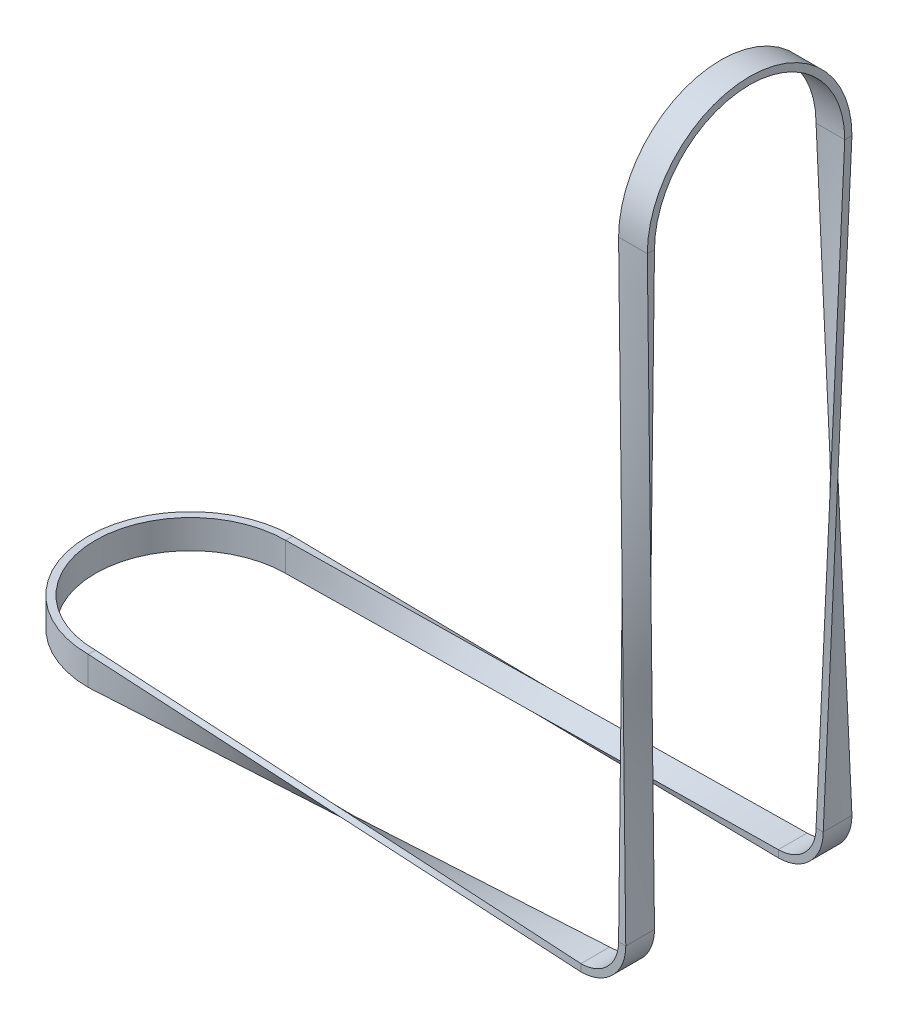
ISO-10303-21;
HEADER;
FILE_DESCRIPTION(('STEP AP214'),'2;1');
FILE_NAME('part.step','',(''),(''),'','','');
FILE_SCHEMA(('AUTOMOTIVE_DESIGN { 1 0 10303 214 1 1 1 1 }'));
ENDSEC;
DATA;
#1=APPLICATION_CONTEXT('core data for automotive mechanical design processes');
#2=APPLICATION_PROTOCOL_DEFINITION('international standard','automotive_design',2000,#1);
#3=PRODUCT_CONTEXT('',#1,'mechanical');
#4=PRODUCT('Part','Part','',(#3));
#5=PRODUCT_RELATED_PRODUCT_CATEGORY('part','',(#4));
#6=PRODUCT_DEFINITION_FORMATION('','',#4);
#7=PRODUCT_DEFINITION_CONTEXT('part definition',#1,'design');
#8=PRODUCT_DEFINITION('design','',#6,#7);
#9=PRODUCT_DEFINITION_SHAPE('','',#8);
#10=(LENGTH_UNIT() NAMED_UNIT(*) SI_UNIT(.MILLI.,.METRE.));
#11=(NAMED_UNIT(*) PLANE_ANGLE_UNIT() SI_UNIT($,.RADIAN.));
#12=(NAMED_UNIT(*) SI_UNIT($,.STERADIAN.) SOLID_ANGLE_UNIT());
#13=UNCERTAINTY_MEASURE_WITH_UNIT(LENGTH_MEASURE(1.E-05),#10,'distance_accuracy_value','');
#14=(GEOMETRIC_REPRESENTATION_CONTEXT(3) GLOBAL_UNCERTAINTY_ASSIGNED_CONTEXT((#13)) GLOBAL_UNIT_ASSIGNED_CONTEXT((#10,
#11,#12)) REPRESENTATION_CONTEXT('',''));
#15=CARTESIAN_POINT('',(0.,0.,0.));
#16=DIRECTION('',(0.,0.,1.));
#17=DIRECTION('',(1.,0.,0.));
#18=AXIS2_PLACEMENT_3D('',#15,#16,#17);
#19=CARTESIAN_POINT('',(-140.25,-7.50000000000001,28.5));
#20=CARTESIAN_POINT('',(0.,-12.5,31.5));
#21=CARTESIAN_POINT('',(-140.25,-8.83333333333335,28.5));
#22=CARTESIAN_POINT('',(0.,-12.5,30.1666666666667));
#23=CARTESIAN_POINT('',(-140.25,-10.1666666666667,28.5));
#24=CARTESIAN_POINT('',(0.,-12.5,28.8333333333333));
#25=CARTESIAN_POINT('',(-140.25,-12.8333333333333,28.5));
#26=CARTESIAN_POINT('',(0.,-12.5,26.1666666666667));
#27=CARTESIAN_POINT('',(-140.25,-14.1666666666667,28.5));
#28=CARTESIAN_POINT('',(0.,-12.5,24.8333333333333));
#29=CARTESIAN_POINT('',(-140.25,-15.5,28.5));
#30=CARTESIAN_POINT('',(0.,-12.5,23.5));
#31=B_SPLINE_SURFACE_WITH_KNOTS('',3,1,((#19,#20),(#21,#22),(#23,#24),(#25,#26),(#27,#28),(#29,
#30)),.UNSPECIFIED.,.F.,.F.,.F.,(4,2,4),(2,2),(0.,0.5,1.),(0.,1.),.UNSPECIFIED.);
#32=DIRECTION('',(0.,-1.,0.));
#33=VECTOR('',#32,1.);
#34=CARTESIAN_POINT('',(-140.25,-7.50000000000001,28.5));
#35=LINE('',#34,#33);
#36=CARTESIAN_POINT('',(-140.25,-7.50000000000001,28.5));
#37=VERTEX_POINT('',#36);
#38=CARTESIAN_POINT('',(-140.25,-10.5000000000002,28.5));
#39=VERTEX_POINT('',#38);
#40=EDGE_CURVE('E911',#37,#39,#35,.T.);
#41=DIRECTION('',(0.,1.,0.));
#42=VECTOR('',#41,1.);
#43=CARTESIAN_POINT('',(-140.25,-15.5,28.5));
#44=LINE('',#43,#42);
#45=CARTESIAN_POINT('',(-140.25,-15.5,28.5));
#46=VERTEX_POINT('',#45);
#47=EDGE_CURVE('E472',#46,#39,#44,.T.);
#48=DIRECTION('',(0.99913686125148,0.02137191147062,-0.0356198524510331));
#49=VECTOR('',#48,1.);
#50=CARTESIAN_POINT('',(-70.125,-14.,26.));
#51=LINE('',#50,#49);
#52=CARTESIAN_POINT('',(0.,-12.5,23.5));
#53=VERTEX_POINT('',#52);
#54=EDGE_CURVE('E979',#46,#53,#51,.T.);
#55=DIRECTION('',(0.,0.,-1.));
#56=VECTOR('',#55,1.);
#57=CARTESIAN_POINT('',(0.,-12.5,31.5));
#58=LINE('',#57,#56);
#59=CARTESIAN_POINT('',(0.,-12.5,31.5));
#60=VERTEX_POINT('',#59);
#61=EDGE_CURVE('E386',#60,#53,#58,.T.);
#62=DIRECTION('',(-0.99913686125148,0.035619852451033,-0.0213719114706199));
#63=VECTOR('',#62,1.);
#64=CARTESIAN_POINT('',(-70.125,-10.,30.));
#65=LINE('',#64,#63);
#66=EDGE_CURVE('E461',#60,#37,#65,.T.);
#67=ORIENTED_EDGE('',*,*,#40,.T.);
#68=ORIENTED_EDGE('',*,*,#47,.F.);
#69=ORIENTED_EDGE('',*,*,#54,.T.);
#70=ORIENTED_EDGE('',*,*,#61,.F.);
#71=ORIENTED_EDGE('',*,*,#66,.T.);
#72=EDGE_LOOP('',(#67,#68,#69,#70,#71));
#73=FACE_BOUND('',#72,.T.);
#74=ADVANCED_FACE('F49',(#73),#31,.T.);
#75=CARTESIAN_POINT('',(-140.25,-15.5,28.5));
#76=CARTESIAN_POINT('',(0.,-12.5,23.5));
#77=CARTESIAN_POINT('',(-140.25,-15.5,28.1666666666667));
#78=CARTESIAN_POINT('',(0.,-12.1666666666667,23.5));
#79=CARTESIAN_POINT('',(-140.25,-15.5,27.8333333333333));
#80=CARTESIAN_POINT('',(0.,-11.8333333333333,23.5));
#81=CARTESIAN_POINT('',(-140.25,-15.5,27.1666666666667));
#82=CARTESIAN_POINT('',(0.,-11.1666666666667,23.5));
#83=CARTESIAN_POINT('',(-140.25,-15.5,26.8333333333333));
#84=CARTESIAN_POINT('',(0.,-10.8333333333333,23.5));
#85=CARTESIAN_POINT('',(-140.25,-15.5,26.5));
#86=CARTESIAN_POINT('',(0.,-10.5,23.5));
#87=B_SPLINE_SURFACE_WITH_KNOTS('',3,1,((#75,#76),(#77,#78),(#79,#80),(#81,#82),(#83,#84),(#85,
#86)),.UNSPECIFIED.,.F.,.F.,.F.,(4,2,4),(2,2),(0.,0.5,1.),(0.,1.),.UNSPECIFIED.);
#88=DIRECTION('',(0.,0.,-1.));
#89=VECTOR('',#88,1.);
#90=CARTESIAN_POINT('',(-140.25,-15.5,28.5));
#91=LINE('',#90,#89);
#92=CARTESIAN_POINT('',(-140.25,-15.5,26.5));
#93=VERTEX_POINT('',#92);
#94=EDGE_CURVE('E902',#46,#93,#91,.T.);
#95=DIRECTION('',(0.99913686125148,0.0356198524510333,-0.0213719114706199));
#96=VECTOR('',#95,1.);
#97=CARTESIAN_POINT('',(-70.125,-13.,25.));
#98=LINE('',#97,#96);
#99=CARTESIAN_POINT('',(0.,-10.5,23.5));
#100=VERTEX_POINT('',#99);
#101=EDGE_CURVE('E977',#93,#100,#98,.T.);
#102=DIRECTION('',(0.,-1.,0.));
#103=VECTOR('',#102,1.);
#104=CARTESIAN_POINT('',(0.,-10.5,23.5));
#105=LINE('',#104,#103);
#106=EDGE_CURVE('E61',#100,#53,#105,.T.);
#107=ORIENTED_EDGE('',*,*,#94,.T.);
#108=ORIENTED_EDGE('',*,*,#101,.T.);
#109=ORIENTED_EDGE('',*,*,#106,.T.);
#110=ORIENTED_EDGE('',*,*,#54,.F.);
#111=EDGE_LOOP('',(#107,#108,#109,#110));
#112=FACE_BOUND('',#111,.T.);
#113=ADVANCED_FACE('F445',(#112),#87,.T.);
#114=CARTESIAN_POINT('',(-140.25,-7.50000000000001,26.5));
#115=CARTESIAN_POINT('',(0.,-10.5,31.5));
#116=CARTESIAN_POINT('',(-140.25,-7.50000000000001,26.8333333333333));
#117=CARTESIAN_POINT('',(0.,-10.8333333333333,31.5));
#118=CARTESIAN_POINT('',(-140.25,-7.50000000000001,27.1666666666666));
#119=CARTESIAN_POINT('',(0.,-11.1666666666667,31.5));
#120=CARTESIAN_POINT('',(-140.25,-7.50000000000001,27.8333333333333));
#121=CARTESIAN_POINT('',(0.,-11.8333333333333,31.5));
#122=CARTESIAN_POINT('',(-140.25,-7.50000000000001,28.1666666666666));
#123=CARTESIAN_POINT('',(0.,-12.1666666666667,31.5));
#124=CARTESIAN_POINT('',(-140.25,-7.50000000000001,28.5));
#125=CARTESIAN_POINT('',(0.,-12.5,31.5));
#126=B_SPLINE_SURFACE_WITH_KNOTS('',3,1,((#114,#115),(#116,#117),(#118,#119),(#120,#121),(#122,
#123),(#124,#125)),.UNSPECIFIED.,.F.,.F.,.F.,(4,2,4),(2,2),(0.,0.5,1.),(0.,1.),.UNSPECIFIED.);
#127=DIRECTION('',(0.,0.,-1.));
#128=VECTOR('',#127,1.);
#129=CARTESIAN_POINT('',(-140.25,-7.50000000000001,28.5));
#130=LINE('',#129,#128);
#131=CARTESIAN_POINT('',(-140.25,-7.50000000000001,26.5));
#132=VERTEX_POINT('',#131);
#133=EDGE_CURVE('E378',#37,#132,#130,.T.);
#134=DIRECTION('',(0.,-1.,0.));
#135=VECTOR('',#134,1.);
#136=CARTESIAN_POINT('',(0.,-10.5,31.5));
#137=LINE('',#136,#135);
#138=CARTESIAN_POINT('',(0.,-10.5,31.5));
#139=VERTEX_POINT('',#138);
#140=EDGE_CURVE('E390',#139,#60,#137,.T.);
#141=DIRECTION('',(0.99913686125148,-0.0213719114706198,0.0356198524510331));
#142=VECTOR('',#141,1.);
#143=CARTESIAN_POINT('',(-70.125,-9.00000000000001,29.));
#144=LINE('',#143,#142);
#145=EDGE_CURVE('E394',#132,#139,#144,.T.);
#146=ORIENTED_EDGE('',*,*,#133,.F.);
#147=ORIENTED_EDGE('',*,*,#66,.F.);
#148=ORIENTED_EDGE('',*,*,#140,.F.);
#149=ORIENTED_EDGE('',*,*,#145,.F.);
#150=EDGE_LOOP('',(#146,#147,#148,#149));
#151=FACE_BOUND('',#150,.T.);
#152=ADVANCED_FACE('F974',(#151),#126,.T.);
#153=CARTESIAN_POINT('',(-140.25,-15.5,26.5));
#154=CARTESIAN_POINT('',(0.,-10.5,23.5));
#155=CARTESIAN_POINT('',(-140.25,-14.1666666666667,26.5));
#156=CARTESIAN_POINT('',(0.,-10.5,24.8333333333333));
#157=CARTESIAN_POINT('',(-140.25,-12.8333333333333,26.5));
#158=CARTESIAN_POINT('',(0.,-10.5,26.1666666666666));
#159=CARTESIAN_POINT('',(-140.25,-10.1666666666667,26.5));
#160=CARTESIAN_POINT('',(0.,-10.5,28.8333333333332));
#161=CARTESIAN_POINT('',(-140.25,-8.83333333333335,26.5));
#162=CARTESIAN_POINT('',(0.,-10.5,30.1666666666666));
#163=CARTESIAN_POINT('',(-140.25,-7.50000000000001,26.5));
#164=CARTESIAN_POINT('',(0.,-10.5,31.5));
#165=B_SPLINE_SURFACE_WITH_KNOTS('',3,1,((#153,#154),(#155,#156),(#157,#158),(#159,#160),(#161,
#162),(#163,#164)),.UNSPECIFIED.,.F.,.F.,.F.,(4,2,4),(2,2),(0.,0.5,1.),(0.,1.),.UNSPECIFIED.);
#166=DIRECTION('',(0.,-1.,0.));
#167=VECTOR('',#166,1.);
#168=CARTESIAN_POINT('',(-140.25,-7.50000000000001,26.5));
#169=LINE('',#168,#167);
#170=CARTESIAN_POINT('',(-140.25,-12.5000000000001,26.5));
#171=VERTEX_POINT('',#170);
#172=EDGE_CURVE('E912',#132,#171,#169,.T.);
#173=DIRECTION('',(0.,0.,-1.));
#174=VECTOR('',#173,1.);
#175=CARTESIAN_POINT('',(0.,-10.5,31.5));
#176=LINE('',#175,#174);
#177=EDGE_CURVE('E12',#139,#100,#176,.T.);
#178=EDGE_CURVE('E483',#171,#93,#169,.T.);
#179=ORIENTED_EDGE('',*,*,#172,.F.);
#180=ORIENTED_EDGE('',*,*,#145,.T.);
#181=ORIENTED_EDGE('',*,*,#177,.T.);
#182=ORIENTED_EDGE('',*,*,#101,.F.);
#183=ORIENTED_EDGE('',*,*,#178,.F.);
#184=EDGE_LOOP('',(#179,#180,#181,#182,#183));
#185=FACE_BOUND('',#184,.T.);
#186=ADVANCED_FACE('F51',(#185),#165,.T.);
#187=CARTESIAN_POINT('',(0.,0.,27.5));
#188=DIRECTION('',(0.,0.,-1.));
#189=DIRECTION('',(-1.,0.,0.));
#190=AXIS2_PLACEMENT_3D('',#187,#188,#189);
#191=CYLINDRICAL_SURFACE('',#190,10.5);
#192=CARTESIAN_POINT('',(0.,0.,23.5));
#193=DIRECTION('',(0.,0.,-1.));
#194=DIRECTION('',(1.,0.,0.));
#195=AXIS2_PLACEMENT_3D('',#192,#193,#194);
#196=CIRCLE('',#195,10.5);
#197=CARTESIAN_POINT('',(10.5,0.,23.5));
#198=VERTEX_POINT('',#197);
#199=EDGE_CURVE('E353',#198,#100,#196,.T.);
#200=ORIENTED_EDGE('',*,*,#199,.T.);
#201=ORIENTED_EDGE('',*,*,#177,.F.);
#202=CARTESIAN_POINT('',(0.,0.,31.5));
#203=DIRECTION('',(0.,0.,-1.));
#204=DIRECTION('',(1.,0.,0.));
#205=AXIS2_PLACEMENT_3D('',#202,#203,#204);
#206=CIRCLE('',#205,10.5);
#207=CARTESIAN_POINT('',(10.5,0.,31.5));
#208=VERTEX_POINT('',#207);
#209=EDGE_CURVE('E356',#208,#139,#206,.T.);
#210=ORIENTED_EDGE('',*,*,#209,.F.);
#211=DIRECTION('',(0.,0.,-1.));
#212=VECTOR('',#211,1.);
#213=CARTESIAN_POINT('',(10.5,0.,31.5));
#214=LINE('',#213,#212);
#215=EDGE_CURVE('E197',#208,#198,#214,.T.);
#216=ORIENTED_EDGE('',*,*,#215,.T.);
#217=EDGE_LOOP('',(#200,#201,#210,#216));
#218=FACE_BOUND('',#217,.T.);
#219=ADVANCED_FACE('F301',(#218),#191,.F.);
#220=CARTESIAN_POINT('',(10.5,0.,23.5));
#221=DIRECTION('',(0.,0.,-1.));
#222=DIRECTION('',(-1.,0.,0.));
#223=AXIS2_PLACEMENT_3D('',#220,#221,#222);
#224=PLANE('',#223);
#225=CARTESIAN_POINT('',(0.,0.,23.5));
#226=DIRECTION('',(0.,0.,-1.));
#227=DIRECTION('',(1.,0.,0.));
#228=AXIS2_PLACEMENT_3D('',#225,#226,#227);
#229=CIRCLE('',#228,12.5);
#230=CARTESIAN_POINT('',(12.5,0.,23.5));
#231=VERTEX_POINT('',#230);
#232=EDGE_CURVE('E363',#231,#53,#229,.T.);
#233=ORIENTED_EDGE('',*,*,#232,.T.);
#234=ORIENTED_EDGE('',*,*,#106,.F.);
#235=ORIENTED_EDGE('',*,*,#199,.F.);
#236=DIRECTION('',(1.,0.,0.));
#237=VECTOR('',#236,1.);
#238=CARTESIAN_POINT('',(10.5,0.,23.5));
#239=LINE('',#238,#237);
#240=EDGE_CURVE('E328',#198,#231,#239,.T.);
#241=ORIENTED_EDGE('',*,*,#240,.T.);
#242=EDGE_LOOP('',(#233,#234,#235,#241));
#243=FACE_BOUND('',#242,.T.);
#244=ADVANCED_FACE('F360',(#243),#224,.T.);
#245=CARTESIAN_POINT('',(0.,0.,27.5));
#246=DIRECTION('',(0.,0.,-1.));
#247=DIRECTION('',(-1.,0.,0.));
#248=AXIS2_PLACEMENT_3D('',#245,#246,#247);
#249=CYLINDRICAL_SURFACE('',#248,12.5);
#250=CARTESIAN_POINT('',(0.,0.,31.5));
#251=DIRECTION('',(0.,0.,-1.));
#252=DIRECTION('',(1.,0.,0.));
#253=AXIS2_PLACEMENT_3D('',#250,#251,#252);
#254=CIRCLE('',#253,12.5);
#255=CARTESIAN_POINT('',(12.5,0.,31.5));
#256=VERTEX_POINT('',#255);
#257=EDGE_CURVE('E365',#256,#60,#254,.T.);
#258=ORIENTED_EDGE('',*,*,#257,.T.);
#259=ORIENTED_EDGE('',*,*,#61,.T.);
#260=ORIENTED_EDGE('',*,*,#232,.F.);
#261=DIRECTION('',(0.,0.,1.));
#262=VECTOR('',#261,1.);
#263=CARTESIAN_POINT('',(12.5,0.,23.5));
#264=LINE('',#263,#262);
#265=EDGE_CURVE('E348',#231,#256,#264,.T.);
#266=ORIENTED_EDGE('',*,*,#265,.T.);
#267=EDGE_LOOP('',(#258,#259,#260,#266));
#268=FACE_BOUND('',#267,.T.);
#269=ADVANCED_FACE('F427',(#268),#249,.T.);
#270=CARTESIAN_POINT('',(12.5,0.,31.5));
#271=DIRECTION('',(0.,0.,1.));
#272=DIRECTION('',(1.,0.,0.));
#273=AXIS2_PLACEMENT_3D('',#270,#271,#272);
#274=PLANE('',#273);
#275=ORIENTED_EDGE('',*,*,#140,.T.);
#276=ORIENTED_EDGE('',*,*,#257,.F.);
#277=DIRECTION('',(-1.,0.,0.));
#278=VECTOR('',#277,1.);
#279=CARTESIAN_POINT('',(12.5,0.,31.5));
#280=LINE('',#279,#278);
#281=EDGE_CURVE('E240',#256,#208,#280,.T.);
#282=ORIENTED_EDGE('',*,*,#281,.T.);
#283=ORIENTED_EDGE('',*,*,#209,.T.);
#284=EDGE_LOOP('',(#275,#276,#282,#283));
#285=FACE_BOUND('',#284,.T.);
#286=ADVANCED_FACE('F300',(#285),#274,.T.);
#287=CARTESIAN_POINT('',(12.5,0.,31.5));
#288=CARTESIAN_POINT('',(7.5,167.,28.5));
#289=CARTESIAN_POINT('',(12.5,0.,30.1666666666667));
#290=CARTESIAN_POINT('',(8.83333333333331,167.,28.5));
#291=CARTESIAN_POINT('',(12.5,0.,28.8333333333333));
#292=CARTESIAN_POINT('',(10.1666666666666,167.,28.5));
#293=CARTESIAN_POINT('',(12.5,0.,26.1666666666667));
#294=CARTESIAN_POINT('',(12.8333333333333,167.,28.5));
#295=CARTESIAN_POINT('',(12.5,0.,24.8333333333333));
#296=CARTESIAN_POINT('',(14.1666666666666,167.,28.5));
#297=CARTESIAN_POINT('',(12.5,0.,23.5));
#298=CARTESIAN_POINT('',(15.5,167.,28.5));
#299=B_SPLINE_SURFACE_WITH_KNOTS('',3,1,((#287,#288),(#289,#290),(#291,#292),(#293,#294),(#295,
#296),(#297,#298)),.UNSPECIFIED.,.F.,.F.,.F.,(4,2,4),(2,2),(0.,0.5,1.),(0.,1.),.UNSPECIFIED.);
#300=DIRECTION('',(0.0179531316907863,0.99939099745377,0.0299218861513105));
#301=VECTOR('',#300,1.);
#302=CARTESIAN_POINT('',(14.,83.5,26.));
#303=LINE('',#302,#301);
#304=CARTESIAN_POINT('',(15.5,167.,28.5));
#305=VERTEX_POINT('',#304);
#306=EDGE_CURVE('E232',#231,#305,#303,.T.);
#307=DIRECTION('',(1.,0.,0.));
#308=VECTOR('',#307,1.);
#309=CARTESIAN_POINT('',(7.5,167.,28.5));
#310=LINE('',#309,#308);
#311=CARTESIAN_POINT('',(7.5,167.,28.5));
#312=VERTEX_POINT('',#311);
#313=EDGE_CURVE('E221',#312,#305,#310,.T.);
#314=DIRECTION('',(0.0299218861513105,-0.99939099745377,0.0179531316907863));
#315=VECTOR('',#314,1.);
#316=CARTESIAN_POINT('',(10.,83.5,30.));
#317=LINE('',#316,#315);
#318=EDGE_CURVE('E220',#312,#256,#317,.T.);
#319=ORIENTED_EDGE('',*,*,#265,.F.);
#320=ORIENTED_EDGE('',*,*,#306,.T.);
#321=ORIENTED_EDGE('',*,*,#313,.F.);
#322=ORIENTED_EDGE('',*,*,#318,.T.);
#323=EDGE_LOOP('',(#319,#320,#321,#322));
#324=FACE_BOUND('',#323,.T.);
#325=ADVANCED_FACE('F289',(#324),#299,.T.);
#326=CARTESIAN_POINT('',(12.5,0.,23.5));
#327=CARTESIAN_POINT('',(15.5,167.,28.5));
#328=CARTESIAN_POINT('',(12.1666666666667,0.,23.5));
#329=CARTESIAN_POINT('',(15.5,167.,28.1666666666667));
#330=CARTESIAN_POINT('',(11.8333333333333,0.,23.5));
#331=CARTESIAN_POINT('',(15.5,167.,27.8333333333333));
#332=CARTESIAN_POINT('',(11.1666666666667,0.,23.5));
#333=CARTESIAN_POINT('',(15.5,167.,27.1666666666666));
#334=CARTESIAN_POINT('',(10.8333333333333,0.,23.5));
#335=CARTESIAN_POINT('',(15.5,167.,26.8333333333333));
#336=CARTESIAN_POINT('',(10.5,0.,23.5));
#337=CARTESIAN_POINT('',(15.5,167.,26.5));
#338=B_SPLINE_SURFACE_WITH_KNOTS('',3,1,((#326,#327),(#328,#329),(#330,#331),(#332,#333),(#334,
#335),(#336,#337)),.UNSPECIFIED.,.F.,.F.,.F.,(4,2,4),(2,2),(0.,0.5,1.),(0.,1.),.UNSPECIFIED.);
#339=DIRECTION('',(0.0299218861513105,0.99939099745377,0.0179531316907863));
#340=VECTOR('',#339,1.);
#341=CARTESIAN_POINT('',(13.,83.5,25.));
#342=LINE('',#341,#340);
#343=CARTESIAN_POINT('',(15.5,167.,26.5));
#344=VERTEX_POINT('',#343);
#345=EDGE_CURVE('E229',#198,#344,#342,.T.);
#346=DIRECTION('',(0.,0.,1.));
#347=VECTOR('',#346,1.);
#348=CARTESIAN_POINT('',(15.5,167.,26.5));
#349=LINE('',#348,#347);
#350=EDGE_CURVE('E198',#344,#305,#349,.T.);
#351=ORIENTED_EDGE('',*,*,#240,.F.);
#352=ORIENTED_EDGE('',*,*,#345,.T.);
#353=ORIENTED_EDGE('',*,*,#350,.T.);
#354=ORIENTED_EDGE('',*,*,#306,.F.);
#355=EDGE_LOOP('',(#351,#352,#353,#354));
#356=FACE_BOUND('',#355,.T.);
#357=ADVANCED_FACE('F257',(#356),#338,.T.);
#358=CARTESIAN_POINT('',(10.5,0.,31.5));
#359=CARTESIAN_POINT('',(7.5,167.,26.5));
#360=CARTESIAN_POINT('',(10.8333333333333,0.,31.5));
#361=CARTESIAN_POINT('',(7.5,167.,26.8333333333333));
#362=CARTESIAN_POINT('',(11.1666666666667,0.,31.5));
#363=CARTESIAN_POINT('',(7.5,167.,27.1666666666667));
#364=CARTESIAN_POINT('',(11.8333333333333,0.,31.5));
#365=CARTESIAN_POINT('',(7.5,167.,27.8333333333333));
#366=CARTESIAN_POINT('',(12.1666666666667,0.,31.5));
#367=CARTESIAN_POINT('',(7.5,167.,28.1666666666667));
#368=CARTESIAN_POINT('',(12.5,0.,31.5));
#369=CARTESIAN_POINT('',(7.5,167.,28.5));
#370=B_SPLINE_SURFACE_WITH_KNOTS('',3,1,((#358,#359),(#360,#361),(#362,#363),(#364,#365),(#366,
#367),(#368,#369)),.UNSPECIFIED.,.F.,.F.,.F.,(4,2,4),(2,2),(0.,0.5,1.),(0.,1.),.UNSPECIFIED.);
#371=DIRECTION('',(0.,0.,1.));
#372=VECTOR('',#371,1.);
#373=CARTESIAN_POINT('',(7.5,167.,26.5));
#374=LINE('',#373,#372);
#375=CARTESIAN_POINT('',(7.5,167.,26.5));
#376=VERTEX_POINT('',#375);
#377=EDGE_CURVE('E206',#376,#312,#374,.T.);
#378=DIRECTION('',(-0.0179531316907863,0.99939099745377,-0.0299218861513105));
#379=VECTOR('',#378,1.);
#380=CARTESIAN_POINT('',(9.,83.5,29.));
#381=LINE('',#380,#379);
#382=EDGE_CURVE('E217',#208,#376,#381,.T.);
#383=ORIENTED_EDGE('',*,*,#281,.F.);
#384=ORIENTED_EDGE('',*,*,#318,.F.);
#385=ORIENTED_EDGE('',*,*,#377,.F.);
#386=ORIENTED_EDGE('',*,*,#382,.F.);
#387=EDGE_LOOP('',(#383,#384,#385,#386));
#388=FACE_BOUND('',#387,.T.);
#389=ADVANCED_FACE('F216',(#388),#370,.T.);
#390=CARTESIAN_POINT('',(10.5,0.,23.5));
#391=CARTESIAN_POINT('',(15.5,167.,26.5));
#392=CARTESIAN_POINT('',(10.5,0.,24.8333333333333));
#393=CARTESIAN_POINT('',(14.1666666666667,167.,26.5));
#394=CARTESIAN_POINT('',(10.5,0.,26.1666666666666));
#395=CARTESIAN_POINT('',(12.8333333333333,167.,26.5));
#396=CARTESIAN_POINT('',(10.5,0.,28.8333333333332));
#397=CARTESIAN_POINT('',(10.1666666666667,167.,26.5));
#398=CARTESIAN_POINT('',(10.5,0.,30.1666666666666));
#399=CARTESIAN_POINT('',(8.83333333333333,167.,26.5));
#400=CARTESIAN_POINT('',(10.5,0.,31.5));
#401=CARTESIAN_POINT('',(7.5,167.,26.5));
#402=B_SPLINE_SURFACE_WITH_KNOTS('',3,1,((#390,#391),(#392,#393),(#394,#395),(#396,#397),(#398,
#399),(#400,#401)),.UNSPECIFIED.,.F.,.F.,.F.,(4,2,4),(2,2),(0.,0.5,1.),(0.,1.),.UNSPECIFIED.);
#403=DIRECTION('',(1.,0.,0.));
#404=VECTOR('',#403,1.);
#405=CARTESIAN_POINT('',(7.5,167.,26.5));
#406=LINE('',#405,#404);
#407=EDGE_CURVE('E184',#376,#344,#406,.T.);
#408=ORIENTED_EDGE('',*,*,#215,.F.);
#409=ORIENTED_EDGE('',*,*,#382,.T.);
#410=ORIENTED_EDGE('',*,*,#407,.T.);
#411=ORIENTED_EDGE('',*,*,#345,.F.);
#412=EDGE_LOOP('',(#408,#409,#410,#411));
#413=FACE_BOUND('',#412,.T.);
#414=ADVANCED_FACE('F225',(#413),#402,.T.);
#415=CARTESIAN_POINT('',(-140.25,-11.5,0.));
#416=DIRECTION('',(0.,-1.,0.));
#417=DIRECTION('',(0.,0.,-1.));
#418=AXIS2_PLACEMENT_3D('',#415,#416,#417);
#419=CYLINDRICAL_SURFACE('',#418,28.5);
#420=CARTESIAN_POINT('',(-140.25,-7.50000000000001,0.));
#421=DIRECTION('',(0.,-1.,0.));
#422=DIRECTION('',(0.,0.,1.));
#423=AXIS2_PLACEMENT_3D('',#420,#421,#422);
#424=CIRCLE('',#423,28.5);
#425=CARTESIAN_POINT('',(-140.25,-7.50000000000001,-28.5));
#426=VERTEX_POINT('',#425);
#427=EDGE_CURVE('E894',#37,#426,#424,.T.);
#428=ORIENTED_EDGE('',*,*,#427,.T.);
#429=DIRECTION('',(0.,-1.,0.));
#430=VECTOR('',#429,1.);
#431=CARTESIAN_POINT('',(-140.25,-7.50000000000001,-28.5));
#432=LINE('',#431,#430);
#433=CARTESIAN_POINT('',(-140.25,-10.5000000000034,-28.5));
#434=VERTEX_POINT('',#433);
#435=EDGE_CURVE('E69',#426,#434,#432,.T.);
#436=ORIENTED_EDGE('',*,*,#435,.T.);
#437=DIRECTION('',(0.,1.,0.));
#438=VECTOR('',#437,1.);
#439=CARTESIAN_POINT('',(-140.25,-15.5,-28.5));
#440=LINE('',#439,#438);
#441=CARTESIAN_POINT('',(-140.25,-15.5,-28.5));
#442=VERTEX_POINT('',#441);
#443=EDGE_CURVE('E741',#442,#434,#440,.T.);
#444=ORIENTED_EDGE('',*,*,#443,.F.);
#445=CARTESIAN_POINT('',(-140.25,-15.5,0.));
#446=DIRECTION('',(0.,-1.,0.));
#447=DIRECTION('',(0.,0.,1.));
#448=AXIS2_PLACEMENT_3D('',#445,#446,#447);
#449=CIRCLE('',#448,28.5);
#450=EDGE_CURVE('E891',#46,#442,#449,.T.);
#451=ORIENTED_EDGE('',*,*,#450,.F.);
#452=ORIENTED_EDGE('',*,*,#47,.T.);
#453=ORIENTED_EDGE('',*,*,#40,.F.);
#454=EDGE_LOOP('',(#428,#436,#444,#451,#452,#453));
#455=FACE_BOUND('',#454,.T.);
#456=ADVANCED_FACE('F636',(#455),#419,.T.);
#457=CARTESIAN_POINT('',(-140.25,-7.50000000000001,28.5));
#458=DIRECTION('',(0.,1.,0.));
#459=DIRECTION('',(0.,0.,1.));
#460=AXIS2_PLACEMENT_3D('',#457,#458,#459);
#461=PLANE('',#460);
#462=CARTESIAN_POINT('',(-140.25,-7.50000000000001,0.));
#463=DIRECTION('',(0.,-1.,0.));
#464=DIRECTION('',(0.,0.,1.));
#465=AXIS2_PLACEMENT_3D('',#462,#463,#464);
#466=CIRCLE('',#465,26.5);
#467=CARTESIAN_POINT('',(-140.25,-7.50000000000001,-26.5));
#468=VERTEX_POINT('',#467);
#469=EDGE_CURVE('E933',#132,#468,#466,.T.);
#470=ORIENTED_EDGE('',*,*,#469,.T.);
#471=DIRECTION('',(0.,0.,1.));
#472=VECTOR('',#471,1.);
#473=CARTESIAN_POINT('',(-140.25,-7.50000000000001,-28.5));
#474=LINE('',#473,#472);
#475=EDGE_CURVE('E873',#426,#468,#474,.T.);
#476=ORIENTED_EDGE('',*,*,#475,.F.);
#477=ORIENTED_EDGE('',*,*,#427,.F.);
#478=ORIENTED_EDGE('',*,*,#133,.T.);
#479=EDGE_LOOP('',(#470,#476,#477,#478));
#480=FACE_BOUND('',#479,.T.);
#481=ADVANCED_FACE('F498',(#480),#461,.T.);
#482=CARTESIAN_POINT('',(-140.25,-11.5,0.));
#483=DIRECTION('',(0.,-1.,0.));
#484=DIRECTION('',(0.,0.,-1.));
#485=AXIS2_PLACEMENT_3D('',#482,#483,#484);
#486=CYLINDRICAL_SURFACE('',#485,26.5);
#487=CARTESIAN_POINT('',(-140.25,-15.5,0.));
#488=DIRECTION('',(0.,-1.,0.));
#489=DIRECTION('',(0.,0.,1.));
#490=AXIS2_PLACEMENT_3D('',#487,#488,#489);
#491=CIRCLE('',#490,26.5);
#492=CARTESIAN_POINT('',(-140.25,-15.5,-26.5));
#493=VERTEX_POINT('',#492);
#494=EDGE_CURVE('E474',#93,#493,#491,.T.);
#495=ORIENTED_EDGE('',*,*,#494,.T.);
#496=DIRECTION('',(0.,-1.,0.));
#497=VECTOR('',#496,1.);
#498=CARTESIAN_POINT('',(-140.25,-7.50000000000001,-26.5));
#499=LINE('',#498,#497);
#500=CARTESIAN_POINT('',(-140.25,-12.4999999999999,-26.5));
#501=VERTEX_POINT('',#500);
#502=EDGE_CURVE('E78',#501,#493,#499,.T.);
#503=ORIENTED_EDGE('',*,*,#502,.F.);
#504=DIRECTION('',(0.,-1.,0.));
#505=VECTOR('',#504,1.);
#506=CARTESIAN_POINT('',(-140.25,-7.50000000000001,-26.5));
#507=LINE('',#506,#505);
#508=EDGE_CURVE('E477',#468,#501,#507,.T.);
#509=ORIENTED_EDGE('',*,*,#508,.F.);
#510=ORIENTED_EDGE('',*,*,#469,.F.);
#511=ORIENTED_EDGE('',*,*,#172,.T.);
#512=ORIENTED_EDGE('',*,*,#178,.T.);
#513=EDGE_LOOP('',(#495,#503,#509,#510,#511,#512));
#514=FACE_BOUND('',#513,.T.);
#515=ADVANCED_FACE('F489',(#514),#486,.F.);
#516=CARTESIAN_POINT('',(-140.25,-15.5,26.5));
#517=DIRECTION('',(0.,-1.,0.));
#518=DIRECTION('',(0.,0.,-1.));
#519=AXIS2_PLACEMENT_3D('',#516,#517,#518);
#520=PLANE('',#519);
#521=DIRECTION('',(0.,0.,-1.));
#522=VECTOR('',#521,1.);
#523=CARTESIAN_POINT('',(-140.25,-15.5,-26.5));
#524=LINE('',#523,#522);
#525=EDGE_CURVE('E476',#493,#442,#524,.T.);
#526=ORIENTED_EDGE('',*,*,#525,.F.);
#527=ORIENTED_EDGE('',*,*,#494,.F.);
#528=ORIENTED_EDGE('',*,*,#94,.F.);
#529=ORIENTED_EDGE('',*,*,#450,.T.);
#530=EDGE_LOOP('',(#526,#527,#528,#529));
#531=FACE_BOUND('',#530,.T.);
#532=ADVANCED_FACE('F302',(#531),#520,.T.);
#533=CARTESIAN_POINT('',(-140.25,-7.50000000000001,-28.5));
#534=CARTESIAN_POINT('',(0.,-12.5,-31.5));
#535=CARTESIAN_POINT('',(-140.25,-8.83333333333335,-28.5));
#536=CARTESIAN_POINT('',(0.,-12.5,-30.1666666666667));
#537=CARTESIAN_POINT('',(-140.25,-10.1666666666667,-28.5));
#538=CARTESIAN_POINT('',(0.,-12.5,-28.8333333333333));
#539=CARTESIAN_POINT('',(-140.25,-12.8333333333333,-28.5));
#540=CARTESIAN_POINT('',(0.,-12.5,-26.1666666666667));
#541=CARTESIAN_POINT('',(-140.25,-14.1666666666667,-28.5));
#542=CARTESIAN_POINT('',(0.,-12.5,-24.8333333333333));
#543=CARTESIAN_POINT('',(-140.25,-15.5,-28.5));
#544=CARTESIAN_POINT('',(0.,-12.5,-23.5));
#545=B_SPLINE_SURFACE_WITH_KNOTS('',3,1,((#533,#534),(#535,#536),(#537,#538),(#539,#540),(#541,
#542),(#543,#544)),.UNSPECIFIED.,.F.,.F.,.F.,(4,2,4),(2,2),(0.,0.5,1.),(0.,1.),.UNSPECIFIED.);
#546=DIRECTION('',(-0.99913686125148,0.035619852451033,0.0213719114706199));
#547=VECTOR('',#546,1.);
#548=CARTESIAN_POINT('',(-70.125,-10.,-30.));
#549=LINE('',#548,#547);
#550=CARTESIAN_POINT('',(0.,-12.5,-31.5));
#551=VERTEX_POINT('',#550);
#552=EDGE_CURVE('E651',#551,#426,#549,.T.);
#553=DIRECTION('',(0.,0.,1.));
#554=VECTOR('',#553,1.);
#555=CARTESIAN_POINT('',(0.,-12.5,-31.5));
#556=LINE('',#555,#554);
#557=CARTESIAN_POINT('',(0.,-12.5,-23.5));
#558=VERTEX_POINT('',#557);
#559=EDGE_CURVE('E551',#551,#558,#556,.T.);
#560=DIRECTION('',(0.99913686125148,0.02137191147062,0.0356198524510331));
#561=VECTOR('',#560,1.);
#562=CARTESIAN_POINT('',(-70.125,-14.,-26.));
#563=LINE('',#562,#561);
#564=EDGE_CURVE('E660',#442,#558,#563,.T.);
#565=ORIENTED_EDGE('',*,*,#435,.F.);
#566=ORIENTED_EDGE('',*,*,#552,.F.);
#567=ORIENTED_EDGE('',*,*,#559,.T.);
#568=ORIENTED_EDGE('',*,*,#564,.F.);
#569=ORIENTED_EDGE('',*,*,#443,.T.);
#570=EDGE_LOOP('',(#565,#566,#567,#568,#569));
#571=FACE_BOUND('',#570,.T.);
#572=ADVANCED_FACE('F628',(#571),#545,.F.);
#573=CARTESIAN_POINT('',(-140.25,-15.5,-28.5));
#574=CARTESIAN_POINT('',(0.,-12.5,-23.5));
#575=CARTESIAN_POINT('',(-140.25,-15.5,-28.1666666666667));
#576=CARTESIAN_POINT('',(0.,-12.1666666666667,-23.5));
#577=CARTESIAN_POINT('',(-140.25,-15.5,-27.8333333333333));
#578=CARTESIAN_POINT('',(0.,-11.8333333333333,-23.5));
#579=CARTESIAN_POINT('',(-140.25,-15.5,-27.1666666666667));
#580=CARTESIAN_POINT('',(0.,-11.1666666666667,-23.5));
#581=CARTESIAN_POINT('',(-140.25,-15.5,-26.8333333333333));
#582=CARTESIAN_POINT('',(0.,-10.8333333333333,-23.5));
#583=CARTESIAN_POINT('',(-140.25,-15.5,-26.5));
#584=CARTESIAN_POINT('',(0.,-10.5,-23.5));
#585=B_SPLINE_SURFACE_WITH_KNOTS('',3,1,((#573,#574),(#575,#576),(#577,#578),(#579,#580),(#581,
#582),(#583,#584)),.UNSPECIFIED.,.F.,.F.,.F.,(4,2,4),(2,2),(0.,0.5,1.),(0.,1.),.UNSPECIFIED.);
#586=DIRECTION('',(0.,-1.,0.));
#587=VECTOR('',#586,1.);
#588=CARTESIAN_POINT('',(0.,-10.5,-23.5));
#589=LINE('',#588,#587);
#590=CARTESIAN_POINT('',(0.,-10.5,-23.5));
#591=VERTEX_POINT('',#590);
#592=EDGE_CURVE('E546',#591,#558,#589,.T.);
#593=DIRECTION('',(0.99913686125148,0.0356198524510333,0.0213719114706199));
#594=VECTOR('',#593,1.);
#595=CARTESIAN_POINT('',(-70.125,-13.,-25.));
#596=LINE('',#595,#594);
#597=EDGE_CURVE('E665',#493,#591,#596,.T.);
#598=ORIENTED_EDGE('',*,*,#525,.T.);
#599=ORIENTED_EDGE('',*,*,#564,.T.);
#600=ORIENTED_EDGE('',*,*,#592,.F.);
#601=ORIENTED_EDGE('',*,*,#597,.F.);
#602=EDGE_LOOP('',(#598,#599,#600,#601));
#603=FACE_BOUND('',#602,.T.);
#604=ADVANCED_FACE('F634',(#603),#585,.F.);
#605=CARTESIAN_POINT('',(-140.25,-7.50000000000001,-26.5));
#606=CARTESIAN_POINT('',(0.,-10.5,-31.5));
#607=CARTESIAN_POINT('',(-140.25,-7.50000000000001,-26.8333333333333));
#608=CARTESIAN_POINT('',(0.,-10.8333333333333,-31.5));
#609=CARTESIAN_POINT('',(-140.25,-7.50000000000001,-27.1666666666666));
#610=CARTESIAN_POINT('',(0.,-11.1666666666667,-31.5));
#611=CARTESIAN_POINT('',(-140.25,-7.50000000000001,-27.8333333333333));
#612=CARTESIAN_POINT('',(0.,-11.8333333333333,-31.5));
#613=CARTESIAN_POINT('',(-140.25,-7.50000000000001,-28.1666666666666));
#614=CARTESIAN_POINT('',(0.,-12.1666666666667,-31.5));
#615=CARTESIAN_POINT('',(-140.25,-7.50000000000001,-28.5));
#616=CARTESIAN_POINT('',(0.,-12.5,-31.5));
#617=B_SPLINE_SURFACE_WITH_KNOTS('',3,1,((#605,#606),(#607,#608),(#609,#610),(#611,#612),(#613,
#614),(#615,#616)),.UNSPECIFIED.,.F.,.F.,.F.,(4,2,4),(2,2),(0.,0.5,1.),(0.,1.),.UNSPECIFIED.);
#618=DIRECTION('',(0.99913686125148,-0.0213719114706198,-0.0356198524510331));
#619=VECTOR('',#618,1.);
#620=CARTESIAN_POINT('',(-70.125,-9.00000000000001,-29.));
#621=LINE('',#620,#619);
#622=CARTESIAN_POINT('',(0.,-10.5,-31.5));
#623=VERTEX_POINT('',#622);
#624=EDGE_CURVE('E561',#468,#623,#621,.T.);
#625=DIRECTION('',(0.,-1.,0.));
#626=VECTOR('',#625,1.);
#627=CARTESIAN_POINT('',(0.,-10.5,-31.5));
#628=LINE('',#627,#626);
#629=EDGE_CURVE('E556',#623,#551,#628,.T.);
#630=ORIENTED_EDGE('',*,*,#475,.T.);
#631=ORIENTED_EDGE('',*,*,#624,.T.);
#632=ORIENTED_EDGE('',*,*,#629,.T.);
#633=ORIENTED_EDGE('',*,*,#552,.T.);
#634=EDGE_LOOP('',(#630,#631,#632,#633));
#635=FACE_BOUND('',#634,.T.);
#636=ADVANCED_FACE('F704',(#635),#617,.F.);
#637=CARTESIAN_POINT('',(-140.25,-15.5,-26.5));
#638=CARTESIAN_POINT('',(0.,-10.5,-23.5));
#639=CARTESIAN_POINT('',(-140.25,-14.1666666666667,-26.5));
#640=CARTESIAN_POINT('',(0.,-10.5,-24.8333333333333));
#641=CARTESIAN_POINT('',(-140.25,-12.8333333333333,-26.5));
#642=CARTESIAN_POINT('',(0.,-10.5,-26.1666666666666));
#643=CARTESIAN_POINT('',(-140.25,-10.1666666666667,-26.5));
#644=CARTESIAN_POINT('',(0.,-10.5,-28.8333333333332));
#645=CARTESIAN_POINT('',(-140.25,-8.83333333333335,-26.5));
#646=CARTESIAN_POINT('',(0.,-10.5,-30.1666666666666));
#647=CARTESIAN_POINT('',(-140.25,-7.50000000000001,-26.5));
#648=CARTESIAN_POINT('',(0.,-10.5,-31.5));
#649=B_SPLINE_SURFACE_WITH_KNOTS('',3,1,((#637,#638),(#639,#640),(#641,#642),(#643,#644),(#645,
#646),(#647,#648)),.UNSPECIFIED.,.F.,.F.,.F.,(4,2,4),(2,2),(0.,0.5,1.),(0.,1.),.UNSPECIFIED.);
#650=DIRECTION('',(0.,0.,1.));
#651=VECTOR('',#650,1.);
#652=CARTESIAN_POINT('',(0.,-10.5,-31.5));
#653=LINE('',#652,#651);
#654=EDGE_CURVE('E543',#623,#591,#653,.T.);
#655=ORIENTED_EDGE('',*,*,#508,.T.);
#656=ORIENTED_EDGE('',*,*,#502,.T.);
#657=ORIENTED_EDGE('',*,*,#597,.T.);
#658=ORIENTED_EDGE('',*,*,#654,.F.);
#659=ORIENTED_EDGE('',*,*,#624,.F.);
#660=EDGE_LOOP('',(#655,#656,#657,#658,#659));
#661=FACE_BOUND('',#660,.T.);
#662=ADVANCED_FACE('F693',(#661),#649,.F.);
#663=CARTESIAN_POINT('',(0.,0.,-27.5));
#664=DIRECTION('',(0.,0.,1.));
#665=DIRECTION('',(-1.,0.,0.));
#666=AXIS2_PLACEMENT_3D('',#663,#664,#665);
#667=CYLINDRICAL_SURFACE('',#666,10.5);
#668=CARTESIAN_POINT('',(0.,0.,-23.5));
#669=DIRECTION('',(0.,0.,-1.));
#670=DIRECTION('',(1.,0.,0.));
#671=AXIS2_PLACEMENT_3D('',#668,#669,#670);
#672=CIRCLE('',#671,10.5);
#673=CARTESIAN_POINT('',(10.5,0.,-23.5));
#674=VERTEX_POINT('',#673);
#675=EDGE_CURVE('E527',#674,#591,#672,.T.);
#676=ORIENTED_EDGE('',*,*,#675,.F.);
#677=DIRECTION('',(0.,0.,1.));
#678=VECTOR('',#677,1.);
#679=CARTESIAN_POINT('',(10.5,0.,-31.5));
#680=LINE('',#679,#678);
#681=CARTESIAN_POINT('',(10.5,0.,-31.5));
#682=VERTEX_POINT('',#681);
#683=EDGE_CURVE('E577',#682,#674,#680,.T.);
#684=ORIENTED_EDGE('',*,*,#683,.F.);
#685=CARTESIAN_POINT('',(0.,0.,-31.5));
#686=DIRECTION('',(0.,0.,-1.));
#687=DIRECTION('',(1.,0.,0.));
#688=AXIS2_PLACEMENT_3D('',#685,#686,#687);
#689=CIRCLE('',#688,10.5);
#690=EDGE_CURVE('E530',#682,#623,#689,.T.);
#691=ORIENTED_EDGE('',*,*,#690,.T.);
#692=ORIENTED_EDGE('',*,*,#654,.T.);
#693=EDGE_LOOP('',(#676,#684,#691,#692));
#694=FACE_BOUND('',#693,.T.);
#695=ADVANCED_FACE('F703',(#694),#667,.F.);
#696=CARTESIAN_POINT('',(10.5,0.,-23.5));
#697=DIRECTION('',(0.,0.,1.));
#698=DIRECTION('',(-1.,0.,0.));
#699=AXIS2_PLACEMENT_3D('',#696,#697,#698);
#700=PLANE('',#699);
#701=CARTESIAN_POINT('',(0.,0.,-23.5));
#702=DIRECTION('',(0.,0.,-1.));
#703=DIRECTION('',(1.,0.,0.));
#704=AXIS2_PLACEMENT_3D('',#701,#702,#703);
#705=CIRCLE('',#704,12.5);
#706=CARTESIAN_POINT('',(12.5,0.,-23.5));
#707=VERTEX_POINT('',#706);
#708=EDGE_CURVE('E529',#707,#558,#705,.T.);
#709=ORIENTED_EDGE('',*,*,#708,.F.);
#710=DIRECTION('',(1.,0.,0.));
#711=VECTOR('',#710,1.);
#712=CARTESIAN_POINT('',(10.5,0.,-23.5));
#713=LINE('',#712,#711);
#714=EDGE_CURVE('E567',#674,#707,#713,.T.);
#715=ORIENTED_EDGE('',*,*,#714,.F.);
#716=ORIENTED_EDGE('',*,*,#675,.T.);
#717=ORIENTED_EDGE('',*,*,#592,.T.);
#718=EDGE_LOOP('',(#709,#715,#716,#717));
#719=FACE_BOUND('',#718,.T.);
#720=ADVANCED_FACE('F621',(#719),#700,.T.);
#721=CARTESIAN_POINT('',(0.,0.,-27.5));
#722=DIRECTION('',(0.,0.,1.));
#723=DIRECTION('',(-1.,0.,0.));
#724=AXIS2_PLACEMENT_3D('',#721,#722,#723);
#725=CYLINDRICAL_SURFACE('',#724,12.5);
#726=CARTESIAN_POINT('',(0.,0.,-31.5));
#727=DIRECTION('',(0.,0.,-1.));
#728=DIRECTION('',(1.,0.,0.));
#729=AXIS2_PLACEMENT_3D('',#726,#727,#728);
#730=CIRCLE('',#729,12.5);
#731=CARTESIAN_POINT('',(12.5,0.,-31.5));
#732=VERTEX_POINT('',#731);
#733=EDGE_CURVE('E521',#732,#551,#730,.T.);
#734=ORIENTED_EDGE('',*,*,#733,.F.);
#735=DIRECTION('',(0.,0.,-1.));
#736=VECTOR('',#735,1.);
#737=CARTESIAN_POINT('',(12.5,0.,-23.5));
#738=LINE('',#737,#736);
#739=EDGE_CURVE('E564',#707,#732,#738,.T.);
#740=ORIENTED_EDGE('',*,*,#739,.F.);
#741=ORIENTED_EDGE('',*,*,#708,.T.);
#742=ORIENTED_EDGE('',*,*,#559,.F.);
#743=EDGE_LOOP('',(#734,#740,#741,#742));
#744=FACE_BOUND('',#743,.T.);
#745=ADVANCED_FACE('F612',(#744),#725,.T.);
#746=CARTESIAN_POINT('',(12.5,0.,-31.5));
#747=DIRECTION('',(0.,0.,-1.));
#748=DIRECTION('',(1.,0.,0.));
#749=AXIS2_PLACEMENT_3D('',#746,#747,#748);
#750=PLANE('',#749);
#751=ORIENTED_EDGE('',*,*,#629,.F.);
#752=ORIENTED_EDGE('',*,*,#690,.F.);
#753=DIRECTION('',(-1.,0.,0.));
#754=VECTOR('',#753,1.);
#755=CARTESIAN_POINT('',(12.5,0.,-31.5));
#756=LINE('',#755,#754);
#757=EDGE_CURVE('E534',#732,#682,#756,.T.);
#758=ORIENTED_EDGE('',*,*,#757,.F.);
#759=ORIENTED_EDGE('',*,*,#733,.T.);
#760=EDGE_LOOP('',(#751,#752,#758,#759));
#761=FACE_BOUND('',#760,.T.);
#762=ADVANCED_FACE('F620',(#761),#750,.T.);
#763=CARTESIAN_POINT('',(12.5,0.,-31.5));
#764=CARTESIAN_POINT('',(7.5,167.,-28.5));
#765=CARTESIAN_POINT('',(12.5,0.,-30.1666666666667));
#766=CARTESIAN_POINT('',(8.83333333333331,167.,-28.5));
#767=CARTESIAN_POINT('',(12.5,0.,-28.8333333333333));
#768=CARTESIAN_POINT('',(10.1666666666666,167.,-28.5));
#769=CARTESIAN_POINT('',(12.5,0.,-26.1666666666667));
#770=CARTESIAN_POINT('',(12.8333333333333,167.,-28.5));
#771=CARTESIAN_POINT('',(12.5,0.,-24.8333333333333));
#772=CARTESIAN_POINT('',(14.1666666666666,167.,-28.5));
#773=CARTESIAN_POINT('',(12.5,0.,-23.5));
#774=CARTESIAN_POINT('',(15.5,167.,-28.5));
#775=B_SPLINE_SURFACE_WITH_KNOTS('',3,1,((#763,#764),(#765,#766),(#767,#768),(#769,#770),(#771,
#772),(#773,#774)),.UNSPECIFIED.,.F.,.F.,.F.,(4,2,4),(2,2),(0.,0.5,1.),(0.,1.),.UNSPECIFIED.);
#776=DIRECTION('',(0.0299218861513105,-0.99939099745377,-0.0179531316907863));
#777=VECTOR('',#776,1.);
#778=CARTESIAN_POINT('',(10.,83.5,-30.));
#779=LINE('',#778,#777);
#780=CARTESIAN_POINT('',(7.5,167.,-28.5));
#781=VERTEX_POINT('',#780);
#782=EDGE_CURVE('E753',#781,#732,#779,.T.);
#783=DIRECTION('',(1.,0.,0.));
#784=VECTOR('',#783,1.);
#785=CARTESIAN_POINT('',(7.5,167.,-28.5));
#786=LINE('',#785,#784);
#787=CARTESIAN_POINT('',(15.5,167.,-28.5));
#788=VERTEX_POINT('',#787);
#789=EDGE_CURVE('E783',#781,#788,#786,.T.);
#790=DIRECTION('',(0.0179531316907863,0.99939099745377,-0.0299218861513105));
#791=VECTOR('',#790,1.);
#792=CARTESIAN_POINT('',(14.,83.5,-26.));
#793=LINE('',#792,#791);
#794=EDGE_CURVE('E779',#707,#788,#793,.T.);
#795=ORIENTED_EDGE('',*,*,#739,.T.);
#796=ORIENTED_EDGE('',*,*,#782,.F.);
#797=ORIENTED_EDGE('',*,*,#789,.T.);
#798=ORIENTED_EDGE('',*,*,#794,.F.);
#799=EDGE_LOOP('',(#795,#796,#797,#798));
#800=FACE_BOUND('',#799,.T.);
#801=ADVANCED_FACE('F626',(#800),#775,.F.);
#802=CARTESIAN_POINT('',(12.5,0.,-23.5));
#803=CARTESIAN_POINT('',(15.5,167.,-28.5));
#804=CARTESIAN_POINT('',(12.1666666666667,0.,-23.5));
#805=CARTESIAN_POINT('',(15.5,167.,-28.1666666666667));
#806=CARTESIAN_POINT('',(11.8333333333333,0.,-23.5));
#807=CARTESIAN_POINT('',(15.5,167.,-27.8333333333333));
#808=CARTESIAN_POINT('',(11.1666666666667,0.,-23.5));
#809=CARTESIAN_POINT('',(15.5,167.,-27.1666666666666));
#810=CARTESIAN_POINT('',(10.8333333333333,0.,-23.5));
#811=CARTESIAN_POINT('',(15.5,167.,-26.8333333333333));
#812=CARTESIAN_POINT('',(10.5,0.,-23.5));
#813=CARTESIAN_POINT('',(15.5,167.,-26.5));
#814=B_SPLINE_SURFACE_WITH_KNOTS('',3,1,((#802,#803),(#804,#805),(#806,#807),(#808,#809),(#810,
#811),(#812,#813)),.UNSPECIFIED.,.F.,.F.,.F.,(4,2,4),(2,2),(0.,0.5,1.),(0.,1.),.UNSPECIFIED.);
#815=DIRECTION('',(0.,0.,-1.));
#816=VECTOR('',#815,1.);
#817=CARTESIAN_POINT('',(15.5,167.,-26.5));
#818=LINE('',#817,#816);
#819=CARTESIAN_POINT('',(15.5,167.,-26.5));
#820=VERTEX_POINT('',#819);
#821=EDGE_CURVE('E768',#820,#788,#818,.T.);
#822=DIRECTION('',(0.0299218861513105,0.99939099745377,-0.0179531316907863));
#823=VECTOR('',#822,1.);
#824=CARTESIAN_POINT('',(13.,83.5,-25.));
#825=LINE('',#824,#823);
#826=EDGE_CURVE('E773',#674,#820,#825,.T.);
#827=ORIENTED_EDGE('',*,*,#714,.T.);
#828=ORIENTED_EDGE('',*,*,#794,.T.);
#829=ORIENTED_EDGE('',*,*,#821,.F.);
#830=ORIENTED_EDGE('',*,*,#826,.F.);
#831=EDGE_LOOP('',(#827,#828,#829,#830));
#832=FACE_BOUND('',#831,.T.);
#833=ADVANCED_FACE('F781',(#832),#814,.F.);
#834=CARTESIAN_POINT('',(10.5,0.,-31.5));
#835=CARTESIAN_POINT('',(7.5,167.,-26.5));
#836=CARTESIAN_POINT('',(10.8333333333333,0.,-31.5));
#837=CARTESIAN_POINT('',(7.5,167.,-26.8333333333333));
#838=CARTESIAN_POINT('',(11.1666666666667,0.,-31.5));
#839=CARTESIAN_POINT('',(7.5,167.,-27.1666666666667));
#840=CARTESIAN_POINT('',(11.8333333333333,0.,-31.5));
#841=CARTESIAN_POINT('',(7.5,167.,-27.8333333333333));
#842=CARTESIAN_POINT('',(12.1666666666667,0.,-31.5));
#843=CARTESIAN_POINT('',(7.5,167.,-28.1666666666667));
#844=CARTESIAN_POINT('',(12.5,0.,-31.5));
#845=CARTESIAN_POINT('',(7.5,167.,-28.5));
#846=B_SPLINE_SURFACE_WITH_KNOTS('',3,1,((#834,#835),(#836,#837),(#838,#839),(#840,#841),(#842,
#843),(#844,#845)),.UNSPECIFIED.,.F.,.F.,.F.,(4,2,4),(2,2),(0.,0.5,1.),(0.,1.),.UNSPECIFIED.);
#847=DIRECTION('',(-0.0179531316907863,0.99939099745377,0.0299218861513105));
#848=VECTOR('',#847,1.);
#849=CARTESIAN_POINT('',(9.,83.5,-29.));
#850=LINE('',#849,#848);
#851=CARTESIAN_POINT('',(7.5,167.,-26.5));
#852=VERTEX_POINT('',#851);
#853=EDGE_CURVE('E778',#682,#852,#850,.T.);
#854=DIRECTION('',(0.,0.,-1.));
#855=VECTOR('',#854,1.);
#856=CARTESIAN_POINT('',(7.5,167.,-26.5));
#857=LINE('',#856,#855);
#858=EDGE_CURVE('E210',#852,#781,#857,.T.);
#859=ORIENTED_EDGE('',*,*,#757,.T.);
#860=ORIENTED_EDGE('',*,*,#853,.T.);
#861=ORIENTED_EDGE('',*,*,#858,.T.);
#862=ORIENTED_EDGE('',*,*,#782,.T.);
#863=EDGE_LOOP('',(#859,#860,#861,#862));
#864=FACE_BOUND('',#863,.T.);
#865=ADVANCED_FACE('F1183',(#864),#846,.F.);
#866=CARTESIAN_POINT('',(10.5,0.,-23.5));
#867=CARTESIAN_POINT('',(15.5,167.,-26.5));
#868=CARTESIAN_POINT('',(10.5,0.,-24.8333333333333));
#869=CARTESIAN_POINT('',(14.1666666666667,167.,-26.5));
#870=CARTESIAN_POINT('',(10.5,0.,-26.1666666666666));
#871=CARTESIAN_POINT('',(12.8333333333333,167.,-26.5));
#872=CARTESIAN_POINT('',(10.5,0.,-28.8333333333332));
#873=CARTESIAN_POINT('',(10.1666666666667,167.,-26.5));
#874=CARTESIAN_POINT('',(10.5,0.,-30.1666666666666));
#875=CARTESIAN_POINT('',(8.83333333333333,167.,-26.5));
#876=CARTESIAN_POINT('',(10.5,0.,-31.5));
#877=CARTESIAN_POINT('',(7.5,167.,-26.5));
#878=B_SPLINE_SURFACE_WITH_KNOTS('',3,1,((#866,#867),(#868,#869),(#870,#871),(#872,#873),(#874,
#875),(#876,#877)),.UNSPECIFIED.,.F.,.F.,.F.,(4,2,4),(2,2),(0.,0.5,1.),(0.,1.),.UNSPECIFIED.);
#879=DIRECTION('',(1.,0.,0.));
#880=VECTOR('',#879,1.);
#881=CARTESIAN_POINT('',(7.5,167.,-26.5));
#882=LINE('',#881,#880);
#883=EDGE_CURVE('E588',#852,#820,#882,.T.);
#884=ORIENTED_EDGE('',*,*,#683,.T.);
#885=ORIENTED_EDGE('',*,*,#826,.T.);
#886=ORIENTED_EDGE('',*,*,#883,.F.);
#887=ORIENTED_EDGE('',*,*,#853,.F.);
#888=EDGE_LOOP('',(#884,#885,#886,#887));
#889=FACE_BOUND('',#888,.T.);
#890=ADVANCED_FACE('F774',(#889),#878,.F.);
#891=CARTESIAN_POINT('',(11.5,167.,0.));
#892=DIRECTION('',(-1.,0.,0.));
#893=DIRECTION('',(0.,0.,1.));
#894=AXIS2_PLACEMENT_3D('',#891,#892,#893);
#895=CYLINDRICAL_SURFACE('',#894,26.5);
#896=CARTESIAN_POINT('',(7.5,167.,0.));
#897=DIRECTION('',(-1.,0.,0.));
#898=DIRECTION('',(0.,0.,1.));
#899=AXIS2_PLACEMENT_3D('',#896,#897,#898);
#900=CIRCLE('',#899,26.5);
#901=EDGE_CURVE('E188',#376,#852,#900,.T.);
#902=ORIENTED_EDGE('',*,*,#901,.T.);
#903=ORIENTED_EDGE('',*,*,#883,.T.);
#904=CARTESIAN_POINT('',(15.5,167.,0.));
#905=DIRECTION('',(-1.,0.,0.));
#906=DIRECTION('',(0.,0.,1.));
#907=AXIS2_PLACEMENT_3D('',#904,#905,#906);
#908=CIRCLE('',#907,26.5);
#909=EDGE_CURVE('E191',#344,#820,#908,.T.);
#910=ORIENTED_EDGE('',*,*,#909,.F.);
#911=ORIENTED_EDGE('',*,*,#407,.F.);
#912=EDGE_LOOP('',(#902,#903,#910,#911));
#913=FACE_BOUND('',#912,.T.);
#914=ADVANCED_FACE('F187',(#913),#895,.F.);
#915=CARTESIAN_POINT('',(7.5,167.,26.5));
#916=DIRECTION('',(-1.,0.,0.));
#917=DIRECTION('',(0.,0.,1.));
#918=AXIS2_PLACEMENT_3D('',#915,#916,#917);
#919=PLANE('',#918);
#920=CARTESIAN_POINT('',(7.5,167.,0.));
#921=DIRECTION('',(-1.,0.,0.));
#922=DIRECTION('',(0.,0.,1.));
#923=AXIS2_PLACEMENT_3D('',#920,#921,#922);
#924=CIRCLE('',#923,28.5);
#925=EDGE_CURVE('E211',#312,#781,#924,.T.);
#926=ORIENTED_EDGE('',*,*,#925,.T.);
#927=ORIENTED_EDGE('',*,*,#858,.F.);
#928=ORIENTED_EDGE('',*,*,#901,.F.);
#929=ORIENTED_EDGE('',*,*,#377,.T.);
#930=EDGE_LOOP('',(#926,#927,#928,#929));
#931=FACE_BOUND('',#930,.T.);
#932=ADVANCED_FACE('F205',(#931),#919,.T.);
#933=CARTESIAN_POINT('',(11.5,167.,0.));
#934=DIRECTION('',(-1.,0.,0.));
#935=DIRECTION('',(0.,0.,1.));
#936=AXIS2_PLACEMENT_3D('',#933,#934,#935);
#937=CYLINDRICAL_SURFACE('',#936,28.5);
#938=CARTESIAN_POINT('',(15.5,167.,0.));
#939=DIRECTION('',(-1.,0.,0.));
#940=DIRECTION('',(0.,0.,1.));
#941=AXIS2_PLACEMENT_3D('',#938,#939,#940);
#942=CIRCLE('',#941,28.5);
#943=EDGE_CURVE('E746',#305,#788,#942,.T.);
#944=ORIENTED_EDGE('',*,*,#943,.T.);
#945=ORIENTED_EDGE('',*,*,#789,.F.);
#946=ORIENTED_EDGE('',*,*,#925,.F.);
#947=ORIENTED_EDGE('',*,*,#313,.T.);
#948=EDGE_LOOP('',(#944,#945,#946,#947));
#949=FACE_BOUND('',#948,.T.);
#950=ADVANCED_FACE('F816',(#949),#937,.T.);
#951=CARTESIAN_POINT('',(15.5,167.,28.5));
#952=DIRECTION('',(1.,0.,0.));
#953=DIRECTION('',(0.,0.,-1.));
#954=AXIS2_PLACEMENT_3D('',#951,#952,#953);
#955=PLANE('',#954);
#956=ORIENTED_EDGE('',*,*,#821,.T.);
#957=ORIENTED_EDGE('',*,*,#943,.F.);
#958=ORIENTED_EDGE('',*,*,#350,.F.);
#959=ORIENTED_EDGE('',*,*,#909,.T.);
#960=EDGE_LOOP('',(#956,#957,#958,#959));
#961=FACE_BOUND('',#960,.T.);
#962=ADVANCED_FACE('F765',(#961),#955,.T.);
#963=CLOSED_SHELL('',(#74,#113,#152,#186,#219,#244,#269,#286,#325,#357,#389,#414,#456,#481,#515,
#532,#572,#604,#636,#662,#695,#720,#745,#762,#801,#833,#865,#890,#914,#932,#950,#962));
#964=MANIFOLD_SOLID_BREP('B2',#963);
#965=ADVANCED_BREP_SHAPE_REPRESENTATION('',(#18,#964),#14);
#966=SHAPE_DEFINITION_REPRESENTATION(#9,#965);
ENDSEC;
END-ISO-10303-21;
